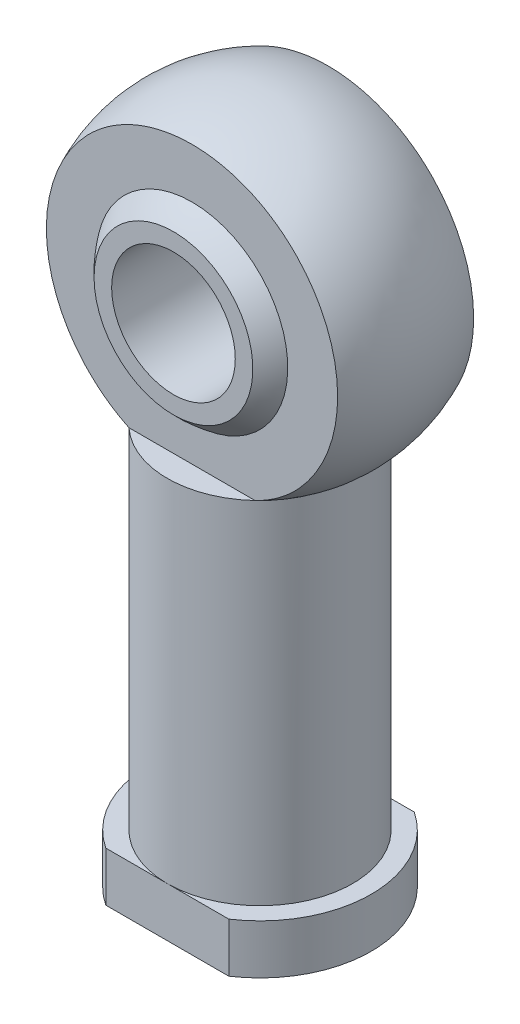
ISO-10303-21;
HEADER;
FILE_DESCRIPTION(('STEP AP214'),'2;1');
FILE_NAME('part.step','',(''),(''),'','','');
FILE_SCHEMA(('AUTOMOTIVE_DESIGN { 1 0 10303 214 1 1 1 1 }'));
ENDSEC;
DATA;
#1=APPLICATION_CONTEXT('core data for automotive mechanical design processes');
#2=APPLICATION_PROTOCOL_DEFINITION('international standard','automotive_design',2000,#1);
#3=PRODUCT_CONTEXT('',#1,'mechanical');
#4=PRODUCT('Part','Part','',(#3));
#5=PRODUCT_RELATED_PRODUCT_CATEGORY('part','',(#4));
#6=PRODUCT_DEFINITION_FORMATION('','',#4);
#7=PRODUCT_DEFINITION_CONTEXT('part definition',#1,'design');
#8=PRODUCT_DEFINITION('design','',#6,#7);
#9=PRODUCT_DEFINITION_SHAPE('','',#8);
#10=(LENGTH_UNIT() NAMED_UNIT(*) SI_UNIT(.MILLI.,.METRE.));
#11=(NAMED_UNIT(*) PLANE_ANGLE_UNIT() SI_UNIT($,.RADIAN.));
#12=(NAMED_UNIT(*) SI_UNIT($,.STERADIAN.) SOLID_ANGLE_UNIT());
#13=UNCERTAINTY_MEASURE_WITH_UNIT(LENGTH_MEASURE(1.E-05),#10,'distance_accuracy_value','');
#14=(GEOMETRIC_REPRESENTATION_CONTEXT(3) GLOBAL_UNCERTAINTY_ASSIGNED_CONTEXT((#13)) GLOBAL_UNIT_ASSIGNED_CONTEXT((#10,
#11,#12)) REPRESENTATION_CONTEXT('',''));
#15=CARTESIAN_POINT('',(0.,0.,0.));
#16=DIRECTION('',(0.,0.,1.));
#17=DIRECTION('',(1.,0.,0.));
#18=AXIS2_PLACEMENT_3D('',#15,#16,#17);
#19=CARTESIAN_POINT('',(0.,4.,0.));
#20=DIRECTION('',(0.,-1.,0.));
#21=DIRECTION('',(0.,0.,-1.));
#22=AXIS2_PLACEMENT_3D('',#19,#20,#21);
#23=PLANE('',#22);
#24=DIRECTION('',(1.,0.,0.));
#25=VECTOR('',#24,1.);
#26=CARTESIAN_POINT('',(0.,4.,-7.5));
#27=LINE('',#26,#25);
#28=CARTESIAN_POINT('',(-4.9749371855331,4.,-7.5));
#29=VERTEX_POINT('',#28);
#30=CARTESIAN_POINT('',(0.,4.,-7.5));
#31=VERTEX_POINT('',#30);
#32=EDGE_CURVE('E245',#29,#31,#27,.T.);
#33=ORIENTED_EDGE('',*,*,#32,.F.);
#34=CARTESIAN_POINT('',(0.,4.,0.));
#35=DIRECTION('',(0.,-1.,0.));
#36=DIRECTION('',(0.,0.,-1.));
#37=AXIS2_PLACEMENT_3D('',#34,#35,#36);
#38=CIRCLE('',#37,9.);
#39=CARTESIAN_POINT('',(-4.9749371855331,4.,7.5));
#40=VERTEX_POINT('',#39);
#41=EDGE_CURVE('E129',#40,#29,#38,.T.);
#42=ORIENTED_EDGE('',*,*,#41,.F.);
#43=DIRECTION('',(-1.,0.,0.));
#44=VECTOR('',#43,1.);
#45=CARTESIAN_POINT('',(0.,4.,7.5));
#46=LINE('',#45,#44);
#47=CARTESIAN_POINT('',(0.,4.,7.5));
#48=VERTEX_POINT('',#47);
#49=EDGE_CURVE('E293',#48,#40,#46,.T.);
#50=ORIENTED_EDGE('',*,*,#49,.F.);
#51=CARTESIAN_POINT('',(0.,4.,0.));
#52=DIRECTION('',(0.,-1.,0.));
#53=DIRECTION('',(0.,0.,-1.));
#54=AXIS2_PLACEMENT_3D('',#51,#52,#53);
#55=CIRCLE('',#54,7.5);
#56=EDGE_CURVE('E141',#48,#31,#55,.T.);
#57=ORIENTED_EDGE('',*,*,#56,.T.);
#58=EDGE_LOOP('',(#33,#42,#50,#57));
#59=FACE_BOUND('',#58,.T.);
#60=ADVANCED_FACE('F46',(#59),#23,.F.);
#61=CARTESIAN_POINT('',(4.9749371855331,4.,-7.5));
#62=VERTEX_POINT('',#61);
#63=EDGE_CURVE('E239',#31,#62,#27,.T.);
#64=ORIENTED_EDGE('',*,*,#63,.F.);
#65=EDGE_CURVE('E142',#31,#48,#55,.T.);
#66=ORIENTED_EDGE('',*,*,#65,.T.);
#67=CARTESIAN_POINT('',(4.9749371855331,4.,7.5));
#68=VERTEX_POINT('',#67);
#69=EDGE_CURVE('E241',#68,#48,#46,.T.);
#70=ORIENTED_EDGE('',*,*,#69,.F.);
#71=EDGE_CURVE('E123',#62,#68,#38,.T.);
#72=ORIENTED_EDGE('',*,*,#71,.F.);
#73=EDGE_LOOP('',(#64,#66,#70,#72));
#74=FACE_BOUND('',#73,.T.);
#75=ADVANCED_FACE('F212',(#74),#23,.F.);
#76=CARTESIAN_POINT('',(0.,0.,0.));
#77=DIRECTION('',(0.,-1.,0.));
#78=DIRECTION('',(0.,0.,-1.));
#79=AXIS2_PLACEMENT_3D('',#76,#77,#78);
#80=CYLINDRICAL_SURFACE('',#79,9.);
#81=DIRECTION('',(0.,-1.,0.));
#82=VECTOR('',#81,1.);
#83=CARTESIAN_POINT('',(4.9749371855331,0.,-7.5));
#84=LINE('',#83,#82);
#85=CARTESIAN_POINT('',(4.9749371855331,0.,-7.5));
#86=VERTEX_POINT('',#85);
#87=EDGE_CURVE('E73',#62,#86,#84,.T.);
#88=ORIENTED_EDGE('',*,*,#87,.F.);
#89=ORIENTED_EDGE('',*,*,#71,.T.);
#90=DIRECTION('',(0.,-1.,0.));
#91=VECTOR('',#90,1.);
#92=CARTESIAN_POINT('',(4.9749371855331,0.,7.5));
#93=LINE('',#92,#91);
#94=CARTESIAN_POINT('',(4.9749371855331,0.,7.5));
#95=VERTEX_POINT('',#94);
#96=EDGE_CURVE('E109',#95,#68,#93,.F.);
#97=ORIENTED_EDGE('',*,*,#96,.F.);
#98=CARTESIAN_POINT('',(0.,0.,0.));
#99=DIRECTION('',(0.,-1.,0.));
#100=DIRECTION('',(0.,0.,-1.));
#101=AXIS2_PLACEMENT_3D('',#98,#99,#100);
#102=CIRCLE('',#101,9.);
#103=EDGE_CURVE('E121',#86,#95,#102,.T.);
#104=ORIENTED_EDGE('',*,*,#103,.F.);
#105=EDGE_LOOP('',(#88,#89,#97,#104));
#106=FACE_BOUND('',#105,.T.);
#107=ADVANCED_FACE('F120',(#106),#80,.T.);
#108=DIRECTION('',(0.,-1.,0.));
#109=VECTOR('',#108,1.);
#110=CARTESIAN_POINT('',(-4.9749371855331,0.,-7.5));
#111=LINE('',#110,#109);
#112=CARTESIAN_POINT('',(-4.9749371855331,0.,-7.5));
#113=VERTEX_POINT('',#112);
#114=EDGE_CURVE('E233',#113,#29,#111,.F.);
#115=ORIENTED_EDGE('',*,*,#114,.F.);
#116=CARTESIAN_POINT('',(-4.9749371855331,0.,7.5));
#117=VERTEX_POINT('',#116);
#118=EDGE_CURVE('E130',#117,#113,#102,.T.);
#119=ORIENTED_EDGE('',*,*,#118,.F.);
#120=DIRECTION('',(0.,-1.,0.));
#121=VECTOR('',#120,1.);
#122=CARTESIAN_POINT('',(-4.9749371855331,0.,7.5));
#123=LINE('',#122,#121);
#124=EDGE_CURVE('E65',#40,#117,#123,.T.);
#125=ORIENTED_EDGE('',*,*,#124,.F.);
#126=ORIENTED_EDGE('',*,*,#41,.T.);
#127=EDGE_LOOP('',(#115,#119,#125,#126));
#128=FACE_BOUND('',#127,.T.);
#129=ADVANCED_FACE('F224',(#128),#80,.T.);
#130=CARTESIAN_POINT('',(0.,0.,0.));
#131=DIRECTION('',(0.,1.,0.));
#132=DIRECTION('',(0.,0.,1.));
#133=AXIS2_PLACEMENT_3D('',#130,#131,#132);
#134=PLANE('',#133);
#135=DIRECTION('',(-1.,0.,0.));
#136=VECTOR('',#135,1.);
#137=CARTESIAN_POINT('',(0.,0.,-7.5));
#138=LINE('',#137,#136);
#139=EDGE_CURVE('E127',#86,#113,#138,.T.);
#140=ORIENTED_EDGE('',*,*,#139,.F.);
#141=ORIENTED_EDGE('',*,*,#103,.T.);
#142=DIRECTION('',(1.,0.,0.));
#143=VECTOR('',#142,1.);
#144=CARTESIAN_POINT('',(0.,0.,7.5));
#145=LINE('',#144,#143);
#146=EDGE_CURVE('E106',#117,#95,#145,.T.);
#147=ORIENTED_EDGE('',*,*,#146,.F.);
#148=ORIENTED_EDGE('',*,*,#118,.T.);
#149=EDGE_LOOP('',(#140,#141,#147,#148));
#150=FACE_BOUND('',#149,.T.);
#151=ADVANCED_FACE('F126',(#150),#134,.F.);
#152=CARTESIAN_POINT('',(0.,43.,0.));
#153=DIRECTION('',(0.,-1.,0.));
#154=DIRECTION('',(-1.,0.,0.));
#155=AXIS2_PLACEMENT_3D('',#152,#153,#154);
#156=SPHERICAL_SURFACE('',#155,13.);
#157=CARTESIAN_POINT('',(0.,32.3816197092023,0.));
#158=DIRECTION('',(0.,-1.,0.));
#159=DIRECTION('',(0.,0.,-1.));
#160=AXIS2_PLACEMENT_3D('',#157,#158,#159);
#161=CIRCLE('',#160,7.5);
#162=CARTESIAN_POINT('',(-5.09901951359277,32.3816197092023,5.50000000000001));
#163=VERTEX_POINT('',#162);
#164=CARTESIAN_POINT('',(-5.09901951359277,32.3816197092023,-5.50000000000001));
#165=VERTEX_POINT('',#164);
#166=EDGE_CURVE('E186',#163,#165,#161,.T.);
#167=ORIENTED_EDGE('',*,*,#166,.F.);
#168=CARTESIAN_POINT('',(0.,43.,5.50000000000001));
#169=DIRECTION('',(0.,0.,-1.));
#170=DIRECTION('',(0.,1.,0.));
#171=AXIS2_PLACEMENT_3D('',#168,#169,#170);
#172=CIRCLE('',#171,11.7792189893897);
#173=CARTESIAN_POINT('',(5.09901951359277,32.3816197092023,5.50000000000001));
#174=VERTEX_POINT('',#173);
#175=EDGE_CURVE('E136',#163,#174,#172,.T.);
#176=ORIENTED_EDGE('',*,*,#175,.T.);
#177=CARTESIAN_POINT('',(5.09901951359277,32.3816197092023,-5.50000000000001));
#178=VERTEX_POINT('',#177);
#179=EDGE_CURVE('E12',#178,#174,#161,.T.);
#180=ORIENTED_EDGE('',*,*,#179,.F.);
#181=CARTESIAN_POINT('',(0.,43.,-5.50000000000001));
#182=DIRECTION('',(0.,0.,1.));
#183=DIRECTION('',(0.,-1.,0.));
#184=AXIS2_PLACEMENT_3D('',#181,#182,#183);
#185=CIRCLE('',#184,11.7792189893897);
#186=EDGE_CURVE('E173',#178,#165,#185,.T.);
#187=ORIENTED_EDGE('',*,*,#186,.T.);
#188=EDGE_LOOP('',(#167,#176,#180,#187));
#189=FACE_BOUND('',#188,.T.);
#190=ADVANCED_FACE('F48',(#189),#156,.T.);
#191=CARTESIAN_POINT('',(0.,0.,0.));
#192=DIRECTION('',(0.,-1.,0.));
#193=DIRECTION('',(0.,0.,-1.));
#194=AXIS2_PLACEMENT_3D('',#191,#192,#193);
#195=CYLINDRICAL_SURFACE('',#194,7.5);
#196=EDGE_CURVE('E58',#165,#178,#161,.T.);
#197=ORIENTED_EDGE('',*,*,#196,.T.);
#198=ORIENTED_EDGE('',*,*,#179,.T.);
#199=EDGE_CURVE('E56',#174,#163,#161,.T.);
#200=ORIENTED_EDGE('',*,*,#199,.T.);
#201=ORIENTED_EDGE('',*,*,#166,.T.);
#202=EDGE_LOOP('',(#197,#198,#200,#201));
#203=FACE_BOUND('',#202,.T.);
#204=ORIENTED_EDGE('',*,*,#65,.F.);
#205=ORIENTED_EDGE('',*,*,#56,.F.);
#206=EDGE_LOOP('',(#204,#205));
#207=FACE_BOUND('',#206,.T.);
#208=ADVANCED_FACE('F189',(#203,#207),#195,.T.);
#209=CARTESIAN_POINT('',(-13.,62.8909424581404,-5.50000000000002));
#210=DIRECTION('',(0.,0.,1.));
#211=DIRECTION('',(0.,-1.,0.));
#212=AXIS2_PLACEMENT_3D('',#209,#210,#211);
#213=PLANE('',#212);
#214=CARTESIAN_POINT('',(0.,43.,-5.50000000000001));
#215=DIRECTION('',(0.,0.,1.));
#216=DIRECTION('',(0.,-1.,0.));
#217=AXIS2_PLACEMENT_3D('',#214,#215,#216);
#218=CIRCLE('',#217,7.74596669241483);
#219=CARTESIAN_POINT('',(0.,35.2540333075852,-5.50000000000001));
#220=VERTEX_POINT('',#219);
#221=EDGE_CURVE('E158',#220,#220,#218,.F.);
#222=ORIENTED_EDGE('',*,*,#221,.F.);
#223=EDGE_LOOP('',(#222));
#224=FACE_BOUND('',#223,.T.);
#225=DIRECTION('',(1.,0.,0.));
#226=VECTOR('',#225,1.);
#227=CARTESIAN_POINT('',(-13.,32.3816197092023,-5.50000000000001));
#228=LINE('',#227,#226);
#229=EDGE_CURVE('E164',#165,#178,#228,.T.);
#230=ORIENTED_EDGE('',*,*,#229,.F.);
#231=ORIENTED_EDGE('',*,*,#186,.F.);
#232=EDGE_LOOP('',(#230,#231));
#233=FACE_BOUND('',#232,.T.);
#234=ADVANCED_FACE('F197',(#224,#233),#213,.F.);
#235=CARTESIAN_POINT('',(-13.,32.3816197092023,-23.0792890347279));
#236=DIRECTION('',(0.,-1.,0.));
#237=DIRECTION('',(0.,0.,-1.));
#238=AXIS2_PLACEMENT_3D('',#235,#236,#237);
#239=PLANE('',#238);
#240=ORIENTED_EDGE('',*,*,#196,.F.);
#241=ORIENTED_EDGE('',*,*,#229,.T.);
#242=EDGE_LOOP('',(#240,#241));
#243=FACE_BOUND('',#242,.T.);
#244=ADVANCED_FACE('F195',(#243),#239,.F.);
#245=CARTESIAN_POINT('',(-13.,62.8909424581404,5.50000000000002));
#246=DIRECTION('',(0.,0.,-1.));
#247=DIRECTION('',(0.,1.,0.));
#248=AXIS2_PLACEMENT_3D('',#245,#246,#247);
#249=PLANE('',#248);
#250=CARTESIAN_POINT('',(0.,43.,5.50000000000001));
#251=DIRECTION('',(0.,0.,-1.));
#252=DIRECTION('',(0.,1.,0.));
#253=AXIS2_PLACEMENT_3D('',#250,#251,#252);
#254=CIRCLE('',#253,7.74596669241483);
#255=CARTESIAN_POINT('',(0.,50.7459666924148,5.50000000000001));
#256=VERTEX_POINT('',#255);
#257=EDGE_CURVE('E153',#256,#256,#254,.F.);
#258=ORIENTED_EDGE('',*,*,#257,.F.);
#259=EDGE_LOOP('',(#258));
#260=FACE_BOUND('',#259,.T.);
#261=DIRECTION('',(1.,0.,0.));
#262=VECTOR('',#261,1.);
#263=CARTESIAN_POINT('',(-13.,32.3816197092023,5.50000000000001));
#264=LINE('',#263,#262);
#265=EDGE_CURVE('E169',#163,#174,#264,.T.);
#266=ORIENTED_EDGE('',*,*,#265,.T.);
#267=ORIENTED_EDGE('',*,*,#175,.F.);
#268=EDGE_LOOP('',(#266,#267));
#269=FACE_BOUND('',#268,.T.);
#270=ADVANCED_FACE('F206',(#260,#269),#249,.F.);
#271=CARTESIAN_POINT('',(-13.,32.3816197092023,23.0792890347279));
#272=DIRECTION('',(0.,-1.,0.));
#273=DIRECTION('',(0.,0.,-1.));
#274=AXIS2_PLACEMENT_3D('',#271,#272,#273);
#275=PLANE('',#274);
#276=ORIENTED_EDGE('',*,*,#199,.F.);
#277=ORIENTED_EDGE('',*,*,#265,.F.);
#278=EDGE_LOOP('',(#276,#277));
#279=FACE_BOUND('',#278,.T.);
#280=ADVANCED_FACE('F279',(#279),#275,.F.);
#281=CARTESIAN_POINT('',(0.,43.,0.));
#282=DIRECTION('',(0.,-1.,0.));
#283=DIRECTION('',(-1.,0.,0.));
#284=AXIS2_PLACEMENT_3D('',#281,#282,#283);
#285=SPHERICAL_SURFACE('',#284,9.5);
#286=CARTESIAN_POINT('',(0.,43.,0.));
#287=DIRECTION('',(0.,0.,-1.));
#288=DIRECTION('',(-1.,0.,0.));
#289=AXIS2_PLACEMENT_3D('',#286,#287,#288);
#290=SPHERICAL_SURFACE('',#289,9.5);
#291=CARTESIAN_POINT('',(0.,43.,7.));
#292=DIRECTION('',(0.,0.,-1.));
#293=DIRECTION('',(-1.,0.,0.));
#294=AXIS2_PLACEMENT_3D('',#291,#292,#293);
#295=CIRCLE('',#294,6.42261628933256);
#296=CARTESIAN_POINT('',(-6.42261628933256,43.,7.));
#297=VERTEX_POINT('',#296);
#298=EDGE_CURVE('E149',#297,#297,#295,.T.);
#299=ORIENTED_EDGE('',*,*,#298,.T.);
#300=EDGE_LOOP('',(#299));
#301=FACE_BOUND('',#300,.T.);
#302=ORIENTED_EDGE('',*,*,#257,.T.);
#303=EDGE_LOOP('',(#302));
#304=FACE_BOUND('',#303,.T.);
#305=ADVANCED_FACE('F277',(#301,#304),#290,.T.);
#306=CARTESIAN_POINT('',(0.,43.,0.));
#307=DIRECTION('',(0.,0.,1.));
#308=DIRECTION('',(1.,0.,0.));
#309=AXIS2_PLACEMENT_3D('',#306,#307,#308);
#310=SPHERICAL_SURFACE('',#309,9.5);
#311=CARTESIAN_POINT('',(0.,43.,-7.));
#312=DIRECTION('',(0.,0.,1.));
#313=DIRECTION('',(1.,0.,0.));
#314=AXIS2_PLACEMENT_3D('',#311,#312,#313);
#315=CIRCLE('',#314,6.42261628933256);
#316=CARTESIAN_POINT('',(6.42261628933256,43.,-7.));
#317=VERTEX_POINT('',#316);
#318=EDGE_CURVE('E146',#317,#317,#315,.T.);
#319=ORIENTED_EDGE('',*,*,#318,.T.);
#320=EDGE_LOOP('',(#319));
#321=FACE_BOUND('',#320,.T.);
#322=ORIENTED_EDGE('',*,*,#221,.T.);
#323=EDGE_LOOP('',(#322));
#324=FACE_BOUND('',#323,.T.);
#325=ADVANCED_FACE('F274',(#321,#324),#310,.T.);
#326=CARTESIAN_POINT('',(-13.,55.339914288414,-7.));
#327=DIRECTION('',(0.,0.,1.));
#328=DIRECTION('',(1.,0.,0.));
#329=AXIS2_PLACEMENT_3D('',#326,#327,#328);
#330=PLANE('',#329);
#331=CARTESIAN_POINT('',(0.,43.,-7.));
#332=DIRECTION('',(0.,0.,1.));
#333=DIRECTION('',(1.,0.,0.));
#334=AXIS2_PLACEMENT_3D('',#331,#332,#333);
#335=CIRCLE('',#334,5.);
#336=CARTESIAN_POINT('',(5.,43.,-7.));
#337=VERTEX_POINT('',#336);
#338=EDGE_CURVE('E150',#337,#337,#335,.T.);
#339=ORIENTED_EDGE('',*,*,#338,.T.);
#340=EDGE_LOOP('',(#339));
#341=FACE_BOUND('',#340,.T.);
#342=ORIENTED_EDGE('',*,*,#318,.F.);
#343=EDGE_LOOP('',(#342));
#344=FACE_BOUND('',#343,.T.);
#345=ADVANCED_FACE('F256',(#341,#344),#330,.F.);
#346=CARTESIAN_POINT('',(-13.,55.339914288414,7.));
#347=DIRECTION('',(0.,0.,-1.));
#348=DIRECTION('',(-1.,0.,0.));
#349=AXIS2_PLACEMENT_3D('',#346,#347,#348);
#350=PLANE('',#349);
#351=CARTESIAN_POINT('',(0.,43.,7.));
#352=DIRECTION('',(0.,0.,-1.));
#353=DIRECTION('',(-1.,0.,0.));
#354=AXIS2_PLACEMENT_3D('',#351,#352,#353);
#355=CIRCLE('',#354,5.);
#356=CARTESIAN_POINT('',(-5.,43.,7.));
#357=VERTEX_POINT('',#356);
#358=EDGE_CURVE('E50',#357,#357,#355,.T.);
#359=ORIENTED_EDGE('',*,*,#358,.T.);
#360=EDGE_LOOP('',(#359));
#361=FACE_BOUND('',#360,.T.);
#362=ORIENTED_EDGE('',*,*,#298,.F.);
#363=EDGE_LOOP('',(#362));
#364=FACE_BOUND('',#363,.T.);
#365=ADVANCED_FACE('F260',(#361,#364),#350,.F.);
#366=CARTESIAN_POINT('',(0.,43.,-9.));
#367=DIRECTION('',(0.,0.,1.));
#368=DIRECTION('',(1.,0.,0.));
#369=AXIS2_PLACEMENT_3D('',#366,#367,#368);
#370=CYLINDRICAL_SURFACE('',#369,5.);
#371=ORIENTED_EDGE('',*,*,#358,.F.);
#372=EDGE_LOOP('',(#371));
#373=FACE_BOUND('',#372,.T.);
#374=ORIENTED_EDGE('',*,*,#338,.F.);
#375=EDGE_LOOP('',(#374));
#376=FACE_BOUND('',#375,.T.);
#377=ADVANCED_FACE('F259',(#373,#376),#370,.F.);
#378=CARTESIAN_POINT('',(-7.56111721977776,56.,7.5));
#379=DIRECTION('',(0.,0.,1.));
#380=DIRECTION('',(1.,0.,0.));
#381=AXIS2_PLACEMENT_3D('',#378,#379,#380);
#382=PLANE('',#381);
#383=ORIENTED_EDGE('',*,*,#69,.T.);
#384=ORIENTED_EDGE('',*,*,#49,.T.);
#385=ORIENTED_EDGE('',*,*,#124,.T.);
#386=ORIENTED_EDGE('',*,*,#146,.T.);
#387=ORIENTED_EDGE('',*,*,#96,.T.);
#388=EDGE_LOOP('',(#383,#384,#385,#386,#387));
#389=FACE_BOUND('',#388,.T.);
#390=ADVANCED_FACE('F108',(#389),#382,.T.);
#391=CARTESIAN_POINT('',(-7.56111721977776,56.,-7.5));
#392=DIRECTION('',(0.,0.,-1.));
#393=DIRECTION('',(-1.,0.,0.));
#394=AXIS2_PLACEMENT_3D('',#391,#392,#393);
#395=PLANE('',#394);
#396=ORIENTED_EDGE('',*,*,#32,.T.);
#397=ORIENTED_EDGE('',*,*,#63,.T.);
#398=ORIENTED_EDGE('',*,*,#87,.T.);
#399=ORIENTED_EDGE('',*,*,#139,.T.);
#400=ORIENTED_EDGE('',*,*,#114,.T.);
#401=EDGE_LOOP('',(#396,#397,#398,#399,#400));
#402=FACE_BOUND('',#401,.T.);
#403=ADVANCED_FACE('F267',(#402),#395,.T.);
#404=CLOSED_SHELL('',(#60,#75,#107,#129,#151,#190,#208,#234,#244,#270,#280,#305,#325,#345,#365,
#377,#390,#403));
#405=MANIFOLD_SOLID_BREP('B2',#404);
#406=ADVANCED_BREP_SHAPE_REPRESENTATION('',(#18,#405),#14);
#407=SHAPE_DEFINITION_REPRESENTATION(#9,#406);
ENDSEC;
END-ISO-10303-21;
